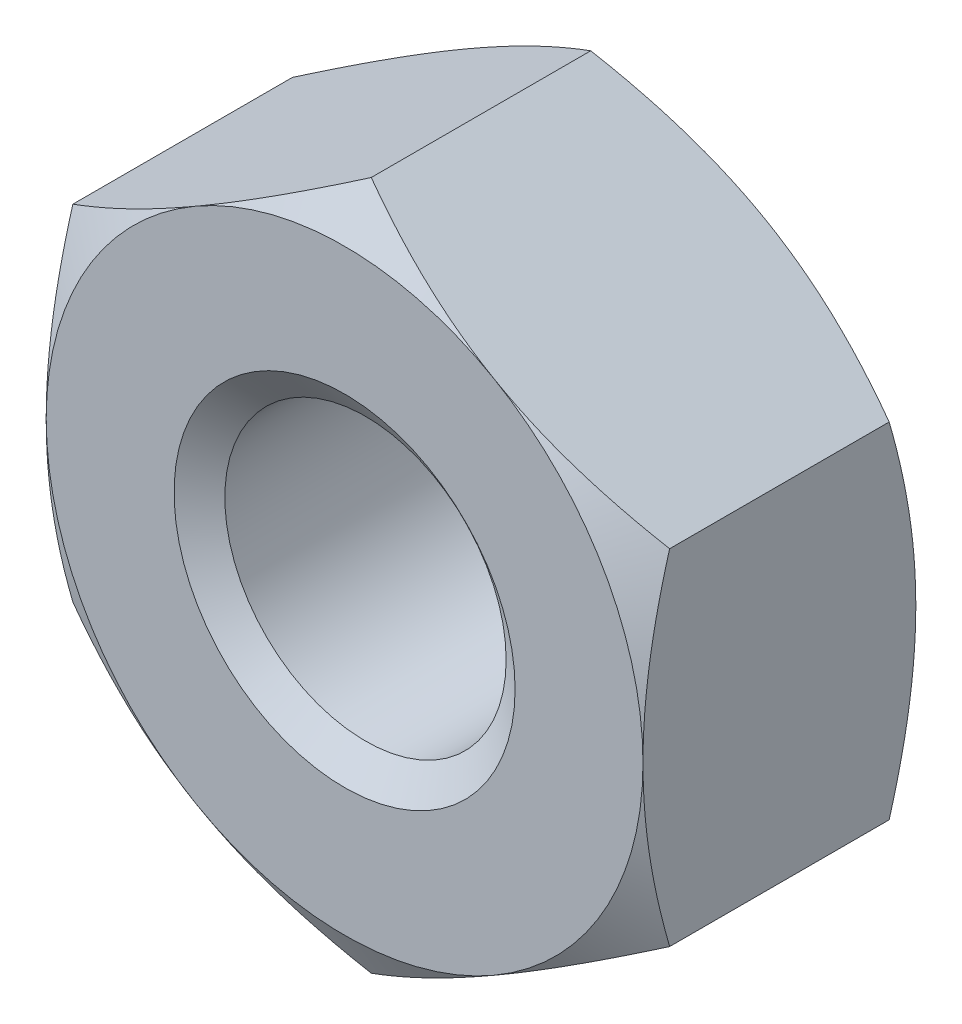
ISO-10303-21;
HEADER;
FILE_DESCRIPTION(('STEP AP214'),'2;1');
FILE_NAME('part.step','',(''),(''),'','','');
FILE_SCHEMA(('AUTOMOTIVE_DESIGN { 1 0 10303 214 1 1 1 1 }'));
ENDSEC;
DATA;
#1=APPLICATION_CONTEXT('core data for automotive mechanical design processes');
#2=APPLICATION_PROTOCOL_DEFINITION('international standard','automotive_design',2000,#1);
#3=PRODUCT_CONTEXT('',#1,'mechanical');
#4=PRODUCT('Part','Part','',(#3));
#5=PRODUCT_RELATED_PRODUCT_CATEGORY('part','',(#4));
#6=PRODUCT_DEFINITION_FORMATION('','',#4);
#7=PRODUCT_DEFINITION_CONTEXT('part definition',#1,'design');
#8=PRODUCT_DEFINITION('design','',#6,#7);
#9=PRODUCT_DEFINITION_SHAPE('','',#8);
#10=(LENGTH_UNIT() NAMED_UNIT(*) SI_UNIT(.MILLI.,.METRE.));
#11=(NAMED_UNIT(*) PLANE_ANGLE_UNIT() SI_UNIT($,.RADIAN.));
#12=(NAMED_UNIT(*) SI_UNIT($,.STERADIAN.) SOLID_ANGLE_UNIT());
#13=UNCERTAINTY_MEASURE_WITH_UNIT(LENGTH_MEASURE(1.E-05),#10,'distance_accuracy_value','');
#14=(GEOMETRIC_REPRESENTATION_CONTEXT(3) GLOBAL_UNCERTAINTY_ASSIGNED_CONTEXT((#13)) GLOBAL_UNIT_ASSIGNED_CONTEXT((#10,
#11,#12)) REPRESENTATION_CONTEXT('',''));
#15=CARTESIAN_POINT('',(0.,0.,0.));
#16=DIRECTION('',(0.,0.,1.));
#17=DIRECTION('',(1.,0.,0.));
#18=AXIS2_PLACEMENT_3D('',#15,#16,#17);
#19=CARTESIAN_POINT('',(0.,0.,-3.2));
#20=DIRECTION('',(0.,0.,1.));
#21=DIRECTION('',(1.,0.,0.));
#22=AXIS2_PLACEMENT_3D('',#19,#20,#21);
#23=CYLINDRICAL_SURFACE('',#22,1.65);
#24=CARTESIAN_POINT('',(0.,0.,-0.245072638373399));
#25=DIRECTION('',(0.,0.,1.));
#26=DIRECTION('',(1.,0.,0.));
#27=AXIS2_PLACEMENT_3D('',#24,#25,#26);
#28=CIRCLE('',#27,1.65);
#29=CARTESIAN_POINT('',(1.65,0.,-0.245072638373399));
#30=VERTEX_POINT('',#29);
#31=EDGE_CURVE('E175',#30,#30,#28,.F.);
#32=ORIENTED_EDGE('',*,*,#31,.F.);
#33=EDGE_LOOP('',(#32));
#34=FACE_BOUND('',#33,.T.);
#35=CARTESIAN_POINT('',(0.,0.,-2.9295273616266));
#36=DIRECTION('',(0.,0.,-1.));
#37=DIRECTION('',(-1.,0.,0.));
#38=AXIS2_PLACEMENT_3D('',#35,#36,#37);
#39=CIRCLE('',#38,1.65);
#40=CARTESIAN_POINT('',(-1.65,0.,-2.9295273616266));
#41=VERTEX_POINT('',#40);
#42=EDGE_CURVE('E40',#41,#41,#39,.F.);
#43=ORIENTED_EDGE('',*,*,#42,.F.);
#44=EDGE_LOOP('',(#43));
#45=FACE_BOUND('',#44,.T.);
#46=ADVANCED_FACE('F35',(#34,#45),#23,.F.);
#47=CARTESIAN_POINT('',(0.,4.04145188432738,-3.2));
#48=DIRECTION('',(-0.500000000000001,0.866025403784438,0.));
#49=DIRECTION('',(-0.866025403784438,-0.500000000000001,0.));
#50=AXIS2_PLACEMENT_3D('',#47,#48,#49);
#51=PLANE('',#50);
#52=DIRECTION('',(0.,0.,1.));
#53=VECTOR('',#52,1.);
#54=CARTESIAN_POINT('',(-3.5,2.02072594216369,-3.2));
#55=LINE('',#54,#53);
#56=CARTESIAN_POINT('',(-3.5,2.02072594216369,-2.88739260883036));
#57=VERTEX_POINT('',#56);
#58=CARTESIAN_POINT('',(-3.5,2.02072594216369,-0.312607391169643));
#59=VERTEX_POINT('',#58);
#60=EDGE_CURVE('E165',#57,#59,#55,.T.);
#61=ORIENTED_EDGE('',*,*,#60,.T.);
#62=CARTESIAN_POINT('',(-3.5002,2.02061047210985,-0.312674060693371));
#63=CARTESIAN_POINT('',(-3.34639282154755,2.10941108799267,-0.261385788989983));
#64=CARTESIAN_POINT('',(-3.19125798916558,2.19897822522909,-0.214740953816197));
#65=CARTESIAN_POINT('',(-2.87830199342322,2.37966345361545,-0.133321875533348));
#66=CARTESIAN_POINT('',(-2.7204752692125,2.47078475532382,-0.0985764355845608));
#67=CARTESIAN_POINT('',(-2.40677778961987,2.65189807961073,-0.0444900271828354));
#68=CARTESIAN_POINT('',(-2.25095530083931,2.74186223545399,-0.0247890862603809));
#69=CARTESIAN_POINT('',(-1.93857711279463,2.92221386641056,-0.00127013273725365));
#70=CARTESIAN_POINT('',(-1.78202254896577,3.01260068598001,0.00256735545443562));
#71=CARTESIAN_POINT('',(-1.48949078007901,3.1814939814933,-0.00541530187697704));
#72=CARTESIAN_POINT('',(-1.35346978754209,3.26002573814993,-0.0152754340696068));
#73=CARTESIAN_POINT('',(-1.08231397971101,3.41657761679354,-0.0465264668994035));
#74=CARTESIAN_POINT('',(-0.947180102315318,3.49459719728458,-0.0679280432857982));
#75=CARTESIAN_POINT('',(-0.675465207594817,3.65147186489429,-0.121430407880577));
#76=CARTESIAN_POINT('',(-0.538918580721665,3.73030709667644,-0.153757994445087));
#77=CARTESIAN_POINT('',(-0.267861907055499,3.88680174018324,-0.227128933807995));
#78=CARTESIAN_POINT('',(-0.133348387531464,3.96446315689009,-0.268155046569868));
#79=CARTESIAN_POINT('',(0.000199999999999524,4.04156735438122,-0.312674060693372));
#80=B_SPLINE_CURVE_WITH_KNOTS('',3,(#62,#63,#64,#65,#66,#67,#68,#69,#70,#71,#72,#73,#74,#75,#76,
#77,#78,#79),.UNSPECIFIED.,.F.,.F.,(4,2,2,2,2,2,2,2,4),(0.,0.554793832886254,1.11092123814984,
1.65328467083219,2.19498204478403,2.6666513085086,3.13875761298267,3.6213361260051,
4.10296698719187),.UNSPECIFIED.);
#81=CARTESIAN_POINT('',(-1.75,3.03108891324553,0.));
#82=VERTEX_POINT('',#81);
#83=EDGE_CURVE('E134',#59,#82,#80,.T.);
#84=ORIENTED_EDGE('',*,*,#83,.T.);
#85=CARTESIAN_POINT('',(0.,4.04145188432738,-0.312607391169644));
#86=VERTEX_POINT('',#85);
#87=EDGE_CURVE('E54',#82,#86,#80,.T.);
#88=ORIENTED_EDGE('',*,*,#87,.T.);
#89=DIRECTION('',(0.,0.,1.));
#90=VECTOR('',#89,1.);
#91=CARTESIAN_POINT('',(0.,4.04145188432738,-3.2));
#92=LINE('',#91,#90);
#93=CARTESIAN_POINT('',(0.,4.04145188432738,-2.88739260883036));
#94=VERTEX_POINT('',#93);
#95=EDGE_CURVE('E150',#94,#86,#92,.T.);
#96=ORIENTED_EDGE('',*,*,#95,.F.);
#97=CARTESIAN_POINT('',(-3.5002,2.02061047210985,-2.88732593930663));
#98=CARTESIAN_POINT('',(-3.34639282154755,2.10941108799267,-2.93861421101002));
#99=CARTESIAN_POINT('',(-3.19125798916558,2.19897822522909,-2.9852590461838));
#100=CARTESIAN_POINT('',(-2.87830199342322,2.37966345361545,-3.06667812446665));
#101=CARTESIAN_POINT('',(-2.7204752692125,2.47078475532382,-3.10142356441544));
#102=CARTESIAN_POINT('',(-2.40677778961987,2.65189807961073,-3.15550997281716));
#103=CARTESIAN_POINT('',(-2.25095530083931,2.74186223545399,-3.17521091373962));
#104=CARTESIAN_POINT('',(-1.93857711279463,2.92221386641055,-3.19872986726275));
#105=CARTESIAN_POINT('',(-1.78202254896577,3.01260068598001,-3.20256735545444));
#106=CARTESIAN_POINT('',(-1.48949078007901,3.1814939814933,-3.19458469812302));
#107=CARTESIAN_POINT('',(-1.35346978754209,3.26002573814993,-3.18472456593039));
#108=CARTESIAN_POINT('',(-1.08231397971101,3.41657761679354,-3.1534735331006));
#109=CARTESIAN_POINT('',(-0.947180102315318,3.49459719728458,-3.1320719567142));
#110=CARTESIAN_POINT('',(-0.675465207594817,3.65147186489429,-3.07856959211942));
#111=CARTESIAN_POINT('',(-0.538918580721665,3.73030709667644,-3.04624200555491));
#112=CARTESIAN_POINT('',(-0.267861907055499,3.88680174018324,-2.97287106619201));
#113=CARTESIAN_POINT('',(-0.133348387531464,3.96446315689009,-2.93184495343013));
#114=CARTESIAN_POINT('',(0.000199999999999536,4.04156735438122,-2.88732593930663));
#115=B_SPLINE_CURVE_WITH_KNOTS('',3,(#97,#98,#99,#100,#101,#102,#103,#104,#105,#106,#107,#108,
#109,#110,#111,#112,#113,#114),.UNSPECIFIED.,.F.,.F.,(4,2,2,2,2,2,2,2,4),(0.,0.554793832886254,
1.11092123814984,1.65328467083219,2.19498204478403,2.6666513085086,3.13875761298267,
3.6213361260051,4.10296698719187),.UNSPECIFIED.);
#116=CARTESIAN_POINT('',(-1.75,3.03108891324553,-3.2));
#117=VERTEX_POINT('',#116);
#118=EDGE_CURVE('E168',#117,#94,#115,.T.);
#119=ORIENTED_EDGE('',*,*,#118,.F.);
#120=EDGE_CURVE('E260',#57,#117,#115,.T.);
#121=ORIENTED_EDGE('',*,*,#120,.F.);
#122=EDGE_LOOP('',(#61,#84,#88,#96,#119,#121));
#123=FACE_BOUND('',#122,.T.);
#124=ADVANCED_FACE('F37',(#123),#51,.T.);
#125=CARTESIAN_POINT('',(3.5,2.02072594216369,-3.2));
#126=DIRECTION('',(0.5,0.866025403784438,0.));
#127=DIRECTION('',(-0.866025403784438,0.5,0.));
#128=AXIS2_PLACEMENT_3D('',#125,#126,#127);
#129=PLANE('',#128);
#130=ORIENTED_EDGE('',*,*,#95,.T.);
#131=CARTESIAN_POINT('',(-0.000200000000000528,4.04156735438122,-0.312674060693372));
#132=CARTESIAN_POINT('',(0.153607178452449,3.9527667384984,-0.261385788989985));
#133=CARTESIAN_POINT('',(0.308742010834424,3.86319960126198,-0.214740953816198));
#134=CARTESIAN_POINT('',(0.621698006576781,3.68251437287562,-0.133321875533349));
#135=CARTESIAN_POINT('',(0.779524730787496,3.59139307116725,-0.0985764355845617));
#136=CARTESIAN_POINT('',(1.09322221038013,3.41027974688034,-0.044490027182836));
#137=CARTESIAN_POINT('',(1.24904469916069,3.32031559103708,-0.0247890862603814));
#138=CARTESIAN_POINT('',(1.56142288720537,3.13996396008052,-0.00127013273725395));
#139=CARTESIAN_POINT('',(1.71797745103423,3.04957714051106,0.0025673554544353));
#140=CARTESIAN_POINT('',(2.01050921992099,2.88068384499777,-0.00541530187697722));
#141=CARTESIAN_POINT('',(2.14653021245791,2.80215208834114,-0.0152754340696068));
#142=CARTESIAN_POINT('',(2.417686020289,2.64560020969753,-0.0465264668994033));
#143=CARTESIAN_POINT('',(2.55281989768468,2.5675806292065,-0.0679280432857978));
#144=CARTESIAN_POINT('',(2.82453479240518,2.41070596159678,-0.121430407880577));
#145=CARTESIAN_POINT('',(2.96108141927834,2.33187072981463,-0.153757994445087));
#146=CARTESIAN_POINT('',(3.2321380929445,2.17537608630783,-0.227128933807994));
#147=CARTESIAN_POINT('',(3.36665161246854,2.09771466960098,-0.268155046569867));
#148=CARTESIAN_POINT('',(3.5002,2.02061047210985,-0.312674060693371));
#149=B_SPLINE_CURVE_WITH_KNOTS('',3,(#131,#132,#133,#134,#135,#136,#137,#138,#139,#140,#141,
#142,#143,#144,#145,#146,#147,#148),.UNSPECIFIED.,.F.,.F.,(4,2,2,2,2,2,2,2,4),(0.,
0.554793832886254,1.11092123814984,1.65328467083219,2.19498204478403,2.6666513085086,
3.13875761298267,3.6213361260051,4.10296698719187),.UNSPECIFIED.);
#150=CARTESIAN_POINT('',(1.75,3.03108891324554,0.));
#151=VERTEX_POINT('',#150);
#152=EDGE_CURVE('E144',#86,#151,#149,.T.);
#153=ORIENTED_EDGE('',*,*,#152,.T.);
#154=CARTESIAN_POINT('',(3.5,2.02072594216369,-0.312607391169644));
#155=VERTEX_POINT('',#154);
#156=EDGE_CURVE('E61',#151,#155,#149,.T.);
#157=ORIENTED_EDGE('',*,*,#156,.T.);
#158=DIRECTION('',(0.,0.,1.));
#159=VECTOR('',#158,1.);
#160=CARTESIAN_POINT('',(3.5,2.02072594216369,-3.2));
#161=LINE('',#160,#159);
#162=CARTESIAN_POINT('',(3.5,2.02072594216369,-2.88739260883036));
#163=VERTEX_POINT('',#162);
#164=EDGE_CURVE('E143',#163,#155,#161,.T.);
#165=ORIENTED_EDGE('',*,*,#164,.F.);
#166=CARTESIAN_POINT('',(-0.000200000000000514,4.04156735438122,-2.88732593930663));
#167=CARTESIAN_POINT('',(0.153607178452449,3.9527667384984,-2.93861421101002));
#168=CARTESIAN_POINT('',(0.308742010834424,3.86319960126198,-2.9852590461838));
#169=CARTESIAN_POINT('',(0.621698006576781,3.68251437287562,-3.06667812446665));
#170=CARTESIAN_POINT('',(0.779524730787496,3.59139307116725,-3.10142356441544));
#171=CARTESIAN_POINT('',(1.09322221038013,3.41027974688034,-3.15550997281716));
#172=CARTESIAN_POINT('',(1.24904469916069,3.32031559103708,-3.17521091373962));
#173=CARTESIAN_POINT('',(1.56142288720537,3.13996396008052,-3.19872986726275));
#174=CARTESIAN_POINT('',(1.71797745103423,3.04957714051106,-3.20256735545444));
#175=CARTESIAN_POINT('',(2.01050921992099,2.88068384499777,-3.19458469812302));
#176=CARTESIAN_POINT('',(2.14653021245791,2.80215208834114,-3.18472456593039));
#177=CARTESIAN_POINT('',(2.417686020289,2.64560020969753,-3.1534735331006));
#178=CARTESIAN_POINT('',(2.55281989768468,2.5675806292065,-3.1320719567142));
#179=CARTESIAN_POINT('',(2.82453479240518,2.41070596159678,-3.07856959211942));
#180=CARTESIAN_POINT('',(2.96108141927834,2.33187072981463,-3.04624200555491));
#181=CARTESIAN_POINT('',(3.2321380929445,2.17537608630783,-2.97287106619201));
#182=CARTESIAN_POINT('',(3.36665161246854,2.09771466960098,-2.93184495343013));
#183=CARTESIAN_POINT('',(3.5002,2.02061047210985,-2.88732593930663));
#184=B_SPLINE_CURVE_WITH_KNOTS('',3,(#166,#167,#168,#169,#170,#171,#172,#173,#174,#175,#176,
#177,#178,#179,#180,#181,#182,#183),.UNSPECIFIED.,.F.,.F.,(4,2,2,2,2,2,2,2,4),(0.,
0.554793832886254,1.11092123814984,1.65328467083219,2.19498204478403,2.6666513085086,
3.13875761298267,3.6213361260051,4.10296698719187),.UNSPECIFIED.);
#185=CARTESIAN_POINT('',(1.75,3.03108891324554,-3.2));
#186=VERTEX_POINT('',#185);
#187=EDGE_CURVE('E254',#186,#163,#184,.T.);
#188=ORIENTED_EDGE('',*,*,#187,.F.);
#189=EDGE_CURVE('E259',#94,#186,#184,.T.);
#190=ORIENTED_EDGE('',*,*,#189,.F.);
#191=EDGE_LOOP('',(#130,#153,#157,#165,#188,#190));
#192=FACE_BOUND('',#191,.T.);
#193=ADVANCED_FACE('F141',(#192),#129,.T.);
#194=CARTESIAN_POINT('',(3.5,2.02072594216369,-3.2));
#195=DIRECTION('',(-1.,0.,0.));
#196=DIRECTION('',(0.,0.,1.));
#197=AXIS2_PLACEMENT_3D('',#194,#195,#196);
#198=PLANE('',#197);
#199=CARTESIAN_POINT('',(3.5,-5.35926299121405,-1.67484346858556));
#200=CARTESIAN_POINT('',(3.5,-5.20559319908841,-1.60058173692104));
#201=CARTESIAN_POINT('',(3.5,-5.05156008083375,-1.52705822833147));
#202=CARTESIAN_POINT('',(3.5,-4.7425707418071,-1.38190950344752));
#203=CARTESIAN_POINT('',(3.5,-4.58761436682436,-1.31028461582133));
#204=CARTESIAN_POINT('',(3.5,-4.27574500225542,-1.16897765517624));
#205=CARTESIAN_POINT('',(3.5,-4.11882589028192,-1.09930904568016));
#206=CARTESIAN_POINT('',(3.5,-3.80369792903855,-0.962964262242759));
#207=CARTESIAN_POINT('',(3.5,-3.64548914750595,-0.896287932319517));
#208=CARTESIAN_POINT('',(3.5,-3.32556618401855,-0.765931819095066));
#209=CARTESIAN_POINT('',(3.5,-3.16383281219923,-0.702298873688864));
#210=CARTESIAN_POINT('',(3.5,-2.83845840945597,-0.580016702089492));
#211=CARTESIAN_POINT('',(3.5,-2.67481716858826,-0.521368030370691));
#212=CARTESIAN_POINT('',(3.5,-2.34570278472049,-0.410630279877021));
#213=CARTESIAN_POINT('',(3.5,-2.18023438248742,-0.358527255435857));
#214=CARTESIAN_POINT('',(3.5,-1.8469452280637,-0.262572936976443));
#215=CARTESIAN_POINT('',(3.5,-1.6791252378753,-0.218719033467158));
#216=CARTESIAN_POINT('',(3.5,-1.34101828610925,-0.141391945584786));
#217=CARTESIAN_POINT('',(3.5,-1.17073068027693,-0.107921525211972));
#218=CARTESIAN_POINT('',(3.5,-0.828102385138484,-0.0536149564320501));
#219=CARTESIAN_POINT('',(3.5,-0.655761694017301,-0.0327788191952362));
#220=CARTESIAN_POINT('',(3.5,-0.311020490924449,-0.00558408650575637));
#221=CARTESIAN_POINT('',(3.5,-0.138627397207259,0.00086616316591159));
#222=CARTESIAN_POINT('',(3.5,0.206038074906535,-0.00105355807794593));
#223=CARTESIAN_POINT('',(3.5,0.37831047302318,-0.00941968196343189));
#224=CARTESIAN_POINT('',(3.5,0.672490555822328,-0.0357688927868921));
#225=CARTESIAN_POINT('',(3.5,0.794722791084093,-0.0503206340384214));
#226=CARTESIAN_POINT('',(3.5,1.0382430543056,-0.0859367340533557));
#227=CARTESIAN_POINT('',(3.5,1.15953093025887,-0.107002119926141));
#228=CARTESIAN_POINT('',(3.5,1.52187914771348,-0.178863187081453));
#229=CARTESIAN_POINT('',(3.5,1.76124104212632,-0.23830527562201));
#230=CARTESIAN_POINT('',(3.5,2.11940971387709,-0.340826814402555));
#231=CARTESIAN_POINT('',(3.5,2.24008344316347,-0.377749699085184));
#232=CARTESIAN_POINT('',(3.5,2.48017139213729,-0.455249007699294));
#233=CARTESIAN_POINT('',(3.5,2.59958641795613,-0.495822911663551));
#234=CARTESIAN_POINT('',(3.5,2.83665760451799,-0.579779986782753));
#235=CARTESIAN_POINT('',(3.5,2.95431988203484,-0.623146060034315));
#236=CARTESIAN_POINT('',(3.5,3.188731535088,-0.712423559566866));
#237=CARTESIAN_POINT('',(3.5,3.30548051959464,-0.75833601459295));
#238=CARTESIAN_POINT('',(3.5,3.42180736613349,-0.805270380724071));
#239=B_SPLINE_CURVE_WITH_KNOTS('',3,(#199,#200,#201,#202,#203,#204,#205,#206,#207,#208,#209,
#210,#211,#212,#213,#214,#215,#216,#217,#218,#219,#220,#221,#222,#223,#224,#225,#226,#227,#228,
#229,#230,#231,#232,#233,#234,#235,#236,#237,#238),.UNSPECIFIED.,.F.,.F.,(4,2,2,2,2,2,2,2,2,2,2,
2,2,2,2,2,2,2,2,4),(0.,0.512025318465737,1.02413870177436,1.53918270315241,2.05419982499223,
2.57553975872798,3.09693761309353,3.617205066104,4.13730766217537,4.65754858684364,
5.17778997146961,5.69470725122282,6.211490334524,6.58059623222331,6.94976036239484,
7.68863804939851,8.06719621660478,8.4454950747676,8.82166461280099,9.1979872473341),.UNSPECIFIED.);
#240=CARTESIAN_POINT('',(3.5,-2.02072594216369,-0.312607391169644));
#241=VERTEX_POINT('',#240);
#242=CARTESIAN_POINT('',(3.5,0.,0.));
#243=VERTEX_POINT('',#242);
#244=EDGE_CURVE('E136',#241,#243,#239,.T.);
#245=ORIENTED_EDGE('',*,*,#244,.F.);
#246=DIRECTION('',(0.,0.,1.));
#247=VECTOR('',#246,1.);
#248=CARTESIAN_POINT('',(3.5,-2.02072594216369,-3.2));
#249=LINE('',#248,#247);
#250=CARTESIAN_POINT('',(3.5,-2.02072594216369,-2.88739260883036));
#251=VERTEX_POINT('',#250);
#252=EDGE_CURVE('E151',#251,#241,#249,.T.);
#253=ORIENTED_EDGE('',*,*,#252,.F.);
#254=CARTESIAN_POINT('',(3.5,-5.35926299121405,-1.52515653141444));
#255=CARTESIAN_POINT('',(3.5,-5.20559319908841,-1.59941826307896));
#256=CARTESIAN_POINT('',(3.5,-5.05156008083375,-1.67294177166853));
#257=CARTESIAN_POINT('',(3.5,-4.7425707418071,-1.81809049655248));
#258=CARTESIAN_POINT('',(3.5,-4.58761436682436,-1.88971538417867));
#259=CARTESIAN_POINT('',(3.5,-4.27574500225542,-2.03102234482376));
#260=CARTESIAN_POINT('',(3.5,-4.11882589028192,-2.10069095431984));
#261=CARTESIAN_POINT('',(3.5,-3.80369792903855,-2.23703573775724));
#262=CARTESIAN_POINT('',(3.5,-3.64548914750595,-2.30371206768048));
#263=CARTESIAN_POINT('',(3.5,-3.32556618401855,-2.43406818090493));
#264=CARTESIAN_POINT('',(3.5,-3.16383281219923,-2.49770112631114));
#265=CARTESIAN_POINT('',(3.5,-2.83845840945597,-2.61998329791051));
#266=CARTESIAN_POINT('',(3.5,-2.67481716858826,-2.67863196962931));
#267=CARTESIAN_POINT('',(3.5,-2.34570278472049,-2.78936972012298));
#268=CARTESIAN_POINT('',(3.5,-2.18023438248742,-2.84147274456414));
#269=CARTESIAN_POINT('',(3.5,-1.8469452280637,-2.93742706302356));
#270=CARTESIAN_POINT('',(3.5,-1.6791252378753,-2.98128096653284));
#271=CARTESIAN_POINT('',(3.5,-1.34101828610925,-3.05860805441521));
#272=CARTESIAN_POINT('',(3.5,-1.17073068027693,-3.09207847478803));
#273=CARTESIAN_POINT('',(3.5,-0.828102385138484,-3.14638504356795));
#274=CARTESIAN_POINT('',(3.5,-0.655761694017301,-3.16722118080476));
#275=CARTESIAN_POINT('',(3.5,-0.311020490924449,-3.19441591349424));
#276=CARTESIAN_POINT('',(3.5,-0.13862739720726,-3.20086616316591));
#277=CARTESIAN_POINT('',(3.5,0.206038074906535,-3.19894644192205));
#278=CARTESIAN_POINT('',(3.5,0.37831047302318,-3.19058031803657));
#279=CARTESIAN_POINT('',(3.5,0.672490555822328,-3.16423110721311));
#280=CARTESIAN_POINT('',(3.5,0.794722791084093,-3.14967936596158));
#281=CARTESIAN_POINT('',(3.5,1.0382430543056,-3.11406326594664));
#282=CARTESIAN_POINT('',(3.5,1.15953093025887,-3.09299788007386));
#283=CARTESIAN_POINT('',(3.5,1.52187914771348,-3.02113681291855));
#284=CARTESIAN_POINT('',(3.5,1.76124104212632,-2.96169472437799));
#285=CARTESIAN_POINT('',(3.5,2.11940971387709,-2.85917318559745));
#286=CARTESIAN_POINT('',(3.5,2.24008344316347,-2.82225030091482));
#287=CARTESIAN_POINT('',(3.5,2.48017139213729,-2.74475099230071));
#288=CARTESIAN_POINT('',(3.5,2.59958641795613,-2.70417708833645));
#289=CARTESIAN_POINT('',(3.5,2.83665760451799,-2.62022001321725));
#290=CARTESIAN_POINT('',(3.5,2.95431988203484,-2.57685393996569));
#291=CARTESIAN_POINT('',(3.5,3.188731535088,-2.48757644043313));
#292=CARTESIAN_POINT('',(3.5,3.30548051959464,-2.44166398540705));
#293=CARTESIAN_POINT('',(3.5,3.42180736613349,-2.39472961927593));
#294=B_SPLINE_CURVE_WITH_KNOTS('',3,(#254,#255,#256,#257,#258,#259,#260,#261,#262,#263,#264,
#265,#266,#267,#268,#269,#270,#271,#272,#273,#274,#275,#276,#277,#278,#279,#280,#281,#282,#283,
#284,#285,#286,#287,#288,#289,#290,#291,#292,#293),.UNSPECIFIED.,.F.,.F.,(4,2,2,2,2,2,2,2,2,2,2,
2,2,2,2,2,2,2,2,4),(0.,0.512025318465737,1.02413870177436,1.53918270315241,2.05419982499223,
2.57553975872798,3.09693761309353,3.617205066104,4.13730766217537,4.65754858684364,
5.17778997146961,5.69470725122282,6.211490334524,6.58059623222331,6.94976036239484,
7.68863804939851,8.06719621660478,8.4454950747676,8.82166461280099,9.1979872473341),.UNSPECIFIED.);
#295=CARTESIAN_POINT('',(3.5,0.,-3.2));
#296=VERTEX_POINT('',#295);
#297=EDGE_CURVE('E266',#251,#296,#294,.T.);
#298=ORIENTED_EDGE('',*,*,#297,.T.);
#299=EDGE_CURVE('E149',#296,#163,#294,.T.);
#300=ORIENTED_EDGE('',*,*,#299,.T.);
#301=ORIENTED_EDGE('',*,*,#164,.T.);
#302=EDGE_CURVE('E126',#243,#155,#239,.T.);
#303=ORIENTED_EDGE('',*,*,#302,.F.);
#304=EDGE_LOOP('',(#245,#253,#298,#300,#301,#303));
#305=FACE_BOUND('',#304,.T.);
#306=ADVANCED_FACE('F147',(#305),#198,.F.);
#307=CARTESIAN_POINT('',(0.,-4.04145188432739,-3.2));
#308=DIRECTION('',(0.5,-0.866025403784438,0.));
#309=DIRECTION('',(0.866025403784438,0.5,0.));
#310=AXIS2_PLACEMENT_3D('',#307,#308,#309);
#311=PLANE('',#310);
#312=ORIENTED_EDGE('',*,*,#252,.T.);
#313=CARTESIAN_POINT('',(3.5002,-2.02061047210986,-0.312674060693372));
#314=CARTESIAN_POINT('',(3.34639282154755,-2.10941108799267,-0.261385788989985));
#315=CARTESIAN_POINT('',(3.19125798916558,-2.19897822522909,-0.214740953816198));
#316=CARTESIAN_POINT('',(2.87830199342322,-2.37966345361545,-0.13332187553335));
#317=CARTESIAN_POINT('',(2.7204752692125,-2.47078475532383,-0.0985764355845625));
#318=CARTESIAN_POINT('',(2.40677778961987,-2.65189807961074,-0.0444900271828371));
#319=CARTESIAN_POINT('',(2.25095530083931,-2.741862235454,-0.0247890862603824));
#320=CARTESIAN_POINT('',(1.93857711279463,-2.92221386641056,-0.0012701327372554));
#321=CARTESIAN_POINT('',(1.78202254896577,-3.01260068598001,0.00256735545443344));
#322=CARTESIAN_POINT('',(1.48949078007901,-3.1814939814933,-0.00541530187697946));
#323=CARTESIAN_POINT('',(1.35346978754209,-3.26002573814993,-0.015275434069609));
#324=CARTESIAN_POINT('',(1.082313979711,-3.41657761679354,-0.0465264668994057));
#325=CARTESIAN_POINT('',(0.947180102315317,-3.49459719728458,-0.0679280432858004));
#326=CARTESIAN_POINT('',(0.675465207594815,-3.65147186489429,-0.12143040788058));
#327=CARTESIAN_POINT('',(0.538918580721664,-3.73030709667644,-0.15375799444509));
#328=CARTESIAN_POINT('',(0.267861907055498,-3.88680174018325,-0.227128933807997));
#329=CARTESIAN_POINT('',(0.133348387531463,-3.96446315689009,-0.26815504656987));
#330=CARTESIAN_POINT('',(-0.000199999999999833,-4.04156735438122,-0.312674060693374));
#331=B_SPLINE_CURVE_WITH_KNOTS('',3,(#313,#314,#315,#316,#317,#318,#319,#320,#321,#322,#323,
#324,#325,#326,#327,#328,#329,#330),.UNSPECIFIED.,.F.,.F.,(4,2,2,2,2,2,2,2,4),(0.,
0.554793832886254,1.11092123814984,1.65328467083219,2.19498204478403,2.6666513085086,
3.13875761298267,3.6213361260051,4.10296698719187),.UNSPECIFIED.);
#332=CARTESIAN_POINT('',(1.75,-3.03108891324553,0.));
#333=VERTEX_POINT('',#332);
#334=EDGE_CURVE('E360',#241,#333,#331,.T.);
#335=ORIENTED_EDGE('',*,*,#334,.T.);
#336=CARTESIAN_POINT('',(0.,-4.04145188432738,-0.312607391169644));
#337=VERTEX_POINT('',#336);
#338=EDGE_CURVE('E226',#333,#337,#331,.T.);
#339=ORIENTED_EDGE('',*,*,#338,.T.);
#340=DIRECTION('',(0.,0.,1.));
#341=VECTOR('',#340,1.);
#342=CARTESIAN_POINT('',(0.,-4.04145188432739,-3.2));
#343=LINE('',#342,#341);
#344=CARTESIAN_POINT('',(0.,-4.04145188432738,-2.88739260883036));
#345=VERTEX_POINT('',#344);
#346=EDGE_CURVE('E156',#345,#337,#343,.T.);
#347=ORIENTED_EDGE('',*,*,#346,.F.);
#348=CARTESIAN_POINT('',(3.5002,-2.02061047210986,-2.88732593930663));
#349=CARTESIAN_POINT('',(3.34639282154755,-2.10941108799267,-2.93861421101002));
#350=CARTESIAN_POINT('',(3.19125798916558,-2.19897822522909,-2.9852590461838));
#351=CARTESIAN_POINT('',(2.87830199342322,-2.37966345361545,-3.06667812446665));
#352=CARTESIAN_POINT('',(2.7204752692125,-2.47078475532383,-3.10142356441544));
#353=CARTESIAN_POINT('',(2.40677778961987,-2.65189807961074,-3.15550997281716));
#354=CARTESIAN_POINT('',(2.25095530083931,-2.741862235454,-3.17521091373962));
#355=CARTESIAN_POINT('',(1.93857711279463,-2.92221386641056,-3.19872986726274));
#356=CARTESIAN_POINT('',(1.78202254896577,-3.01260068598001,-3.20256735545443));
#357=CARTESIAN_POINT('',(1.48949078007901,-3.1814939814933,-3.19458469812302));
#358=CARTESIAN_POINT('',(1.35346978754209,-3.26002573814993,-3.18472456593039));
#359=CARTESIAN_POINT('',(1.082313979711,-3.41657761679354,-3.15347353310059));
#360=CARTESIAN_POINT('',(0.947180102315316,-3.49459719728458,-3.1320719567142));
#361=CARTESIAN_POINT('',(0.675465207594815,-3.65147186489429,-3.07856959211942));
#362=CARTESIAN_POINT('',(0.538918580721664,-3.73030709667644,-3.04624200555491));
#363=CARTESIAN_POINT('',(0.267861907055498,-3.88680174018325,-2.972871066192));
#364=CARTESIAN_POINT('',(0.133348387531463,-3.96446315689009,-2.93184495343013));
#365=CARTESIAN_POINT('',(-0.000199999999999835,-4.04156735438122,-2.88732593930663));
#366=B_SPLINE_CURVE_WITH_KNOTS('',3,(#348,#349,#350,#351,#352,#353,#354,#355,#356,#357,#358,
#359,#360,#361,#362,#363,#364,#365),.UNSPECIFIED.,.F.,.F.,(4,2,2,2,2,2,2,2,4),(0.,
0.554793832886254,1.11092123814984,1.65328467083219,2.19498204478403,2.6666513085086,
3.13875761298267,3.6213361260051,4.10296698719187),.UNSPECIFIED.);
#367=CARTESIAN_POINT('',(1.75,-3.03108891324553,-3.2));
#368=VERTEX_POINT('',#367);
#369=EDGE_CURVE('E272',#368,#345,#366,.T.);
#370=ORIENTED_EDGE('',*,*,#369,.F.);
#371=EDGE_CURVE('E271',#251,#368,#366,.T.);
#372=ORIENTED_EDGE('',*,*,#371,.F.);
#373=EDGE_LOOP('',(#312,#335,#339,#347,#370,#372));
#374=FACE_BOUND('',#373,.T.);
#375=ADVANCED_FACE('F282',(#374),#311,.T.);
#376=CARTESIAN_POINT('',(-3.5,-2.02072594216369,-3.2));
#377=DIRECTION('',(-0.5,-0.866025403784438,0.));
#378=DIRECTION('',(0.866025403784439,-0.5,0.));
#379=AXIS2_PLACEMENT_3D('',#376,#377,#378);
#380=PLANE('',#379);
#381=ORIENTED_EDGE('',*,*,#346,.T.);
#382=CARTESIAN_POINT('',(0.00020000000000034,-4.04156735438122,-0.312674060693374));
#383=CARTESIAN_POINT('',(-0.153607178452449,-3.9527667384984,-0.261385788989986));
#384=CARTESIAN_POINT('',(-0.308742010834424,-3.86319960126198,-0.214740953816199));
#385=CARTESIAN_POINT('',(-0.621698006576782,-3.68251437287563,-0.133321875533351));
#386=CARTESIAN_POINT('',(-0.779524730787497,-3.59139307116725,-0.0985764355845636));
#387=CARTESIAN_POINT('',(-1.09322221038013,-3.41027974688034,-0.0444900271828381));
#388=CARTESIAN_POINT('',(-1.24904469916069,-3.32031559103708,-0.0247890862603834));
#389=CARTESIAN_POINT('',(-1.56142288720538,-3.13996396008052,-0.0012701327372559));
#390=CARTESIAN_POINT('',(-1.71797745103423,-3.04957714051106,0.00256735545443343));
#391=CARTESIAN_POINT('',(-2.01050921992099,-2.88068384499778,-0.0054153018769791));
#392=CARTESIAN_POINT('',(-2.14653021245791,-2.80215208834115,-0.0152754340696087));
#393=CARTESIAN_POINT('',(-2.417686020289,-2.64560020969754,-0.0465264668994052));
#394=CARTESIAN_POINT('',(-2.55281989768468,-2.5675806292065,-0.0679280432857998));
#395=CARTESIAN_POINT('',(-2.82453479240518,-2.41070596159679,-0.121430407880579));
#396=CARTESIAN_POINT('',(-2.96108141927834,-2.33187072981464,-0.153757994445088));
#397=CARTESIAN_POINT('',(-3.2321380929445,-2.17537608630783,-0.227128933807996));
#398=CARTESIAN_POINT('',(-3.36665161246854,-2.09771466960099,-0.268155046569868));
#399=CARTESIAN_POINT('',(-3.5002,-2.02061047210986,-0.312674060693372));
#400=B_SPLINE_CURVE_WITH_KNOTS('',3,(#382,#383,#384,#385,#386,#387,#388,#389,#390,#391,#392,
#393,#394,#395,#396,#397,#398,#399),.UNSPECIFIED.,.F.,.F.,(4,2,2,2,2,2,2,2,4),(0.,
0.554793832886255,1.11092123814984,1.65328467083219,2.19498204478403,2.6666513085086,
3.13875761298267,3.6213361260051,4.10296698719187),.UNSPECIFIED.);
#401=CARTESIAN_POINT('',(-1.75,-3.03108891324554,0.));
#402=VERTEX_POINT('',#401);
#403=EDGE_CURVE('E357',#337,#402,#400,.T.);
#404=ORIENTED_EDGE('',*,*,#403,.T.);
#405=CARTESIAN_POINT('',(-3.5,-2.02072594216369,-0.312607391169644));
#406=VERTEX_POINT('',#405);
#407=EDGE_CURVE('E200',#402,#406,#400,.T.);
#408=ORIENTED_EDGE('',*,*,#407,.T.);
#409=DIRECTION('',(0.,0.,1.));
#410=VECTOR('',#409,1.);
#411=CARTESIAN_POINT('',(-3.5,-2.02072594216369,-3.2));
#412=LINE('',#411,#410);
#413=CARTESIAN_POINT('',(-3.5,-2.02072594216369,-2.88739260883036));
#414=VERTEX_POINT('',#413);
#415=EDGE_CURVE('E162',#414,#406,#412,.T.);
#416=ORIENTED_EDGE('',*,*,#415,.F.);
#417=CARTESIAN_POINT('',(0.00020000000000025,-4.04156735438122,-2.88732593930663));
#418=CARTESIAN_POINT('',(-0.153607178452449,-3.9527667384984,-2.93861421101001));
#419=CARTESIAN_POINT('',(-0.308742010834424,-3.86319960126198,-2.9852590461838));
#420=CARTESIAN_POINT('',(-0.621698006576782,-3.68251437287563,-3.06667812446665));
#421=CARTESIAN_POINT('',(-0.779524730787497,-3.59139307116725,-3.10142356441544));
#422=CARTESIAN_POINT('',(-1.09322221038013,-3.41027974688034,-3.15550997281716));
#423=CARTESIAN_POINT('',(-1.24904469916069,-3.32031559103708,-3.17521091373962));
#424=CARTESIAN_POINT('',(-1.56142288720538,-3.13996396008052,-3.19872986726274));
#425=CARTESIAN_POINT('',(-1.71797745103423,-3.04957714051106,-3.20256735545443));
#426=CARTESIAN_POINT('',(-2.01050921992099,-2.88068384499778,-3.19458469812302));
#427=CARTESIAN_POINT('',(-2.14653021245791,-2.80215208834115,-3.18472456593039));
#428=CARTESIAN_POINT('',(-2.417686020289,-2.64560020969754,-3.1534735331006));
#429=CARTESIAN_POINT('',(-2.55281989768468,-2.5675806292065,-3.1320719567142));
#430=CARTESIAN_POINT('',(-2.82453479240518,-2.41070596159679,-3.07856959211942));
#431=CARTESIAN_POINT('',(-2.96108141927834,-2.33187072981464,-3.04624200555491));
#432=CARTESIAN_POINT('',(-3.2321380929445,-2.17537608630783,-2.972871066192));
#433=CARTESIAN_POINT('',(-3.36665161246854,-2.09771466960099,-2.93184495343013));
#434=CARTESIAN_POINT('',(-3.5002,-2.02061047210986,-2.88732593930663));
#435=B_SPLINE_CURVE_WITH_KNOTS('',3,(#417,#418,#419,#420,#421,#422,#423,#424,#425,#426,#427,
#428,#429,#430,#431,#432,#433,#434),.UNSPECIFIED.,.F.,.F.,(4,2,2,2,2,2,2,2,4),(0.,
0.554793832886254,1.11092123814984,1.65328467083219,2.19498204478403,2.6666513085086,
3.13875761298267,3.6213361260051,4.10296698719187),.UNSPECIFIED.);
#436=CARTESIAN_POINT('',(-1.75,-3.03108891324554,-3.2));
#437=VERTEX_POINT('',#436);
#438=EDGE_CURVE('E278',#437,#414,#435,.T.);
#439=ORIENTED_EDGE('',*,*,#438,.F.);
#440=EDGE_CURVE('E277',#345,#437,#435,.T.);
#441=ORIENTED_EDGE('',*,*,#440,.F.);
#442=EDGE_LOOP('',(#381,#404,#408,#416,#439,#441));
#443=FACE_BOUND('',#442,.T.);
#444=ADVANCED_FACE('F285',(#443),#380,.T.);
#445=CARTESIAN_POINT('',(-3.5,2.02072594216369,-3.2));
#446=DIRECTION('',(-1.,0.,0.));
#447=DIRECTION('',(0.,0.,1.));
#448=AXIS2_PLACEMENT_3D('',#445,#446,#447);
#449=PLANE('',#448);
#450=ORIENTED_EDGE('',*,*,#415,.T.);
#451=CARTESIAN_POINT('',(-3.5,-5.35926299121405,-1.67484346858556));
#452=CARTESIAN_POINT('',(-3.5,-5.20559319908842,-1.60058173692104));
#453=CARTESIAN_POINT('',(-3.5,-5.05156008083375,-1.52705822833147));
#454=CARTESIAN_POINT('',(-3.5,-4.7425707418071,-1.38190950344752));
#455=CARTESIAN_POINT('',(-3.5,-4.58761436682436,-1.31028461582133));
#456=CARTESIAN_POINT('',(-3.5,-4.27574500225542,-1.16897765517624));
#457=CARTESIAN_POINT('',(-3.5,-4.11882589028192,-1.09930904568016));
#458=CARTESIAN_POINT('',(-3.5,-3.80369792903855,-0.96296426224276));
#459=CARTESIAN_POINT('',(-3.5,-3.64548914750595,-0.896287932319518));
#460=CARTESIAN_POINT('',(-3.5,-3.32556618401855,-0.765931819095067));
#461=CARTESIAN_POINT('',(-3.5,-3.16383281219924,-0.702298873688865));
#462=CARTESIAN_POINT('',(-3.5,-2.83845840945597,-0.580016702089493));
#463=CARTESIAN_POINT('',(-3.5,-2.67481716858826,-0.521368030370692));
#464=CARTESIAN_POINT('',(-3.5,-2.34570278472049,-0.410630279877022));
#465=CARTESIAN_POINT('',(-3.5,-2.18023438248742,-0.358527255435857));
#466=CARTESIAN_POINT('',(-3.5,-1.8469452280637,-0.262572936976443));
#467=CARTESIAN_POINT('',(-3.5,-1.6791252378753,-0.218719033467158));
#468=CARTESIAN_POINT('',(-3.5,-1.34101828610925,-0.141391945584787));
#469=CARTESIAN_POINT('',(-3.5,-1.17073068027693,-0.107921525211973));
#470=CARTESIAN_POINT('',(-3.5,-0.828102385138485,-0.0536149564320504));
#471=CARTESIAN_POINT('',(-3.5,-0.655761694017302,-0.0327788191952365));
#472=CARTESIAN_POINT('',(-3.5,-0.31102049092445,-0.00558408650575658));
#473=CARTESIAN_POINT('',(-3.5,-0.13862739720726,0.000866163165911488));
#474=CARTESIAN_POINT('',(-3.5,0.206038074906534,-0.00105355807794583));
#475=CARTESIAN_POINT('',(-3.5,0.378310473023179,-0.00941968196343169));
#476=CARTESIAN_POINT('',(-3.5,0.672490555822327,-0.0357688927868918));
#477=CARTESIAN_POINT('',(-3.5,0.794722791084092,-0.0503206340384211));
#478=CARTESIAN_POINT('',(-3.5,1.0382430543056,-0.0859367340533555));
#479=CARTESIAN_POINT('',(-3.5,1.15953093025887,-0.107002119926141));
#480=CARTESIAN_POINT('',(-3.5,1.52187914771348,-0.178863187081452));
#481=CARTESIAN_POINT('',(-3.5,1.76124104212632,-0.23830527562201));
#482=CARTESIAN_POINT('',(-3.5,2.11940971387708,-0.340826814402554));
#483=CARTESIAN_POINT('',(-3.5,2.24008344316346,-0.377749699085183));
#484=CARTESIAN_POINT('',(-3.5,2.48017139213729,-0.455249007699293));
#485=CARTESIAN_POINT('',(-3.5,2.59958641795613,-0.49582291166355));
#486=CARTESIAN_POINT('',(-3.5,2.83665760451799,-0.579779986782752));
#487=CARTESIAN_POINT('',(-3.5,2.95431988203484,-0.623146060034314));
#488=CARTESIAN_POINT('',(-3.5,3.188731535088,-0.712423559566866));
#489=CARTESIAN_POINT('',(-3.5,3.30548051959464,-0.75833601459295));
#490=CARTESIAN_POINT('',(-3.5,3.42180736613349,-0.805270380724071));
#491=B_SPLINE_CURVE_WITH_KNOTS('',3,(#451,#452,#453,#454,#455,#456,#457,#458,#459,#460,#461,
#462,#463,#464,#465,#466,#467,#468,#469,#470,#471,#472,#473,#474,#475,#476,#477,#478,#479,#480,
#481,#482,#483,#484,#485,#486,#487,#488,#489,#490),.UNSPECIFIED.,.F.,.F.,(4,2,2,2,2,2,2,2,2,2,2,
2,2,2,2,2,2,2,2,4),(0.,0.512025318465737,1.02413870177436,1.53918270315241,2.05419982499223,
2.57553975872798,3.09693761309353,3.617205066104,4.13730766217537,4.65754858684364,
5.17778997146961,5.69470725122282,6.211490334524,6.58059623222331,6.94976036239484,
7.68863804939851,8.06719621660478,8.4454950747676,8.82166461280099,9.1979872473341),.UNSPECIFIED.);
#492=CARTESIAN_POINT('',(-3.5,0.,0.));
#493=VERTEX_POINT('',#492);
#494=EDGE_CURVE('E199',#406,#493,#491,.T.);
#495=ORIENTED_EDGE('',*,*,#494,.T.);
#496=EDGE_CURVE('E192',#493,#59,#491,.T.);
#497=ORIENTED_EDGE('',*,*,#496,.T.);
#498=ORIENTED_EDGE('',*,*,#60,.F.);
#499=CARTESIAN_POINT('',(-3.5,-5.35926299121405,-1.52515653141444));
#500=CARTESIAN_POINT('',(-3.5,-5.20559319908841,-1.59941826307896));
#501=CARTESIAN_POINT('',(-3.5,-5.05156008083375,-1.67294177166853));
#502=CARTESIAN_POINT('',(-3.5,-4.7425707418071,-1.81809049655248));
#503=CARTESIAN_POINT('',(-3.5,-4.58761436682437,-1.88971538417867));
#504=CARTESIAN_POINT('',(-3.5,-4.27574500225542,-2.03102234482376));
#505=CARTESIAN_POINT('',(-3.5,-4.11882589028192,-2.10069095431984));
#506=CARTESIAN_POINT('',(-3.5,-3.80369792903855,-2.23703573775724));
#507=CARTESIAN_POINT('',(-3.5,-3.64548914750595,-2.30371206768048));
#508=CARTESIAN_POINT('',(-3.5,-3.32556618401855,-2.43406818090493));
#509=CARTESIAN_POINT('',(-3.5,-3.16383281219924,-2.49770112631114));
#510=CARTESIAN_POINT('',(-3.5,-2.83845840945597,-2.61998329791051));
#511=CARTESIAN_POINT('',(-3.5,-2.67481716858826,-2.67863196962931));
#512=CARTESIAN_POINT('',(-3.5,-2.34570278472049,-2.78936972012298));
#513=CARTESIAN_POINT('',(-3.5,-2.18023438248742,-2.84147274456414));
#514=CARTESIAN_POINT('',(-3.5,-1.8469452280637,-2.93742706302356));
#515=CARTESIAN_POINT('',(-3.5,-1.6791252378753,-2.98128096653284));
#516=CARTESIAN_POINT('',(-3.5,-1.34101828610925,-3.05860805441521));
#517=CARTESIAN_POINT('',(-3.5,-1.17073068027693,-3.09207847478803));
#518=CARTESIAN_POINT('',(-3.5,-0.828102385138485,-3.14638504356795));
#519=CARTESIAN_POINT('',(-3.5,-0.655761694017302,-3.16722118080476));
#520=CARTESIAN_POINT('',(-3.5,-0.31102049092445,-3.19441591349424));
#521=CARTESIAN_POINT('',(-3.5,-0.13862739720726,-3.20086616316591));
#522=CARTESIAN_POINT('',(-3.5,0.206038074906535,-3.19894644192205));
#523=CARTESIAN_POINT('',(-3.5,0.378310473023179,-3.19058031803657));
#524=CARTESIAN_POINT('',(-3.5,0.672490555822327,-3.16423110721311));
#525=CARTESIAN_POINT('',(-3.5,0.794722791084092,-3.14967936596158));
#526=CARTESIAN_POINT('',(-3.5,1.0382430543056,-3.11406326594664));
#527=CARTESIAN_POINT('',(-3.5,1.15953093025887,-3.09299788007386));
#528=CARTESIAN_POINT('',(-3.5,1.52187914771348,-3.02113681291855));
#529=CARTESIAN_POINT('',(-3.5,1.76124104212632,-2.96169472437799));
#530=CARTESIAN_POINT('',(-3.5,2.11940971387708,-2.85917318559745));
#531=CARTESIAN_POINT('',(-3.5,2.24008344316346,-2.82225030091482));
#532=CARTESIAN_POINT('',(-3.5,2.48017139213729,-2.74475099230071));
#533=CARTESIAN_POINT('',(-3.5,2.59958641795613,-2.70417708833645));
#534=CARTESIAN_POINT('',(-3.5,2.83665760451798,-2.62022001321725));
#535=CARTESIAN_POINT('',(-3.5,2.95431988203484,-2.57685393996569));
#536=CARTESIAN_POINT('',(-3.5,3.188731535088,-2.48757644043313));
#537=CARTESIAN_POINT('',(-3.5,3.30548051959464,-2.44166398540705));
#538=CARTESIAN_POINT('',(-3.5,3.42180736613349,-2.39472961927593));
#539=B_SPLINE_CURVE_WITH_KNOTS('',3,(#499,#500,#501,#502,#503,#504,#505,#506,#507,#508,#509,
#510,#511,#512,#513,#514,#515,#516,#517,#518,#519,#520,#521,#522,#523,#524,#525,#526,#527,#528,
#529,#530,#531,#532,#533,#534,#535,#536,#537,#538),.UNSPECIFIED.,.F.,.F.,(4,2,2,2,2,2,2,2,2,2,2,
2,2,2,2,2,2,2,2,4),(0.,0.512025318465737,1.02413870177436,1.53918270315241,2.05419982499223,
2.57553975872798,3.09693761309353,3.617205066104,4.13730766217537,4.65754858684364,
5.17778997146961,5.69470725122282,6.211490334524,6.58059623222331,6.94976036239485,
7.68863804939851,8.06719621660478,8.4454950747676,8.82166461280099,9.1979872473341),.UNSPECIFIED.);
#540=CARTESIAN_POINT('',(-3.5,0.,-3.2));
#541=VERTEX_POINT('',#540);
#542=EDGE_CURVE('E329',#541,#57,#539,.T.);
#543=ORIENTED_EDGE('',*,*,#542,.F.);
#544=EDGE_CURVE('E332',#414,#541,#539,.T.);
#545=ORIENTED_EDGE('',*,*,#544,.F.);
#546=EDGE_LOOP('',(#450,#495,#497,#498,#543,#545));
#547=FACE_BOUND('',#546,.T.);
#548=ADVANCED_FACE('F206',(#547),#449,.T.);
#549=CARTESIAN_POINT('',(0.,4.04145188432738,0.));
#550=DIRECTION('',(0.,0.,-1.));
#551=DIRECTION('',(-1.,0.,0.));
#552=AXIS2_PLACEMENT_3D('',#549,#550,#551);
#553=PLANE('',#552);
#554=CARTESIAN_POINT('',(0.,0.,0.));
#555=DIRECTION('',(0.,0.,1.));
#556=DIRECTION('',(1.,0.,0.));
#557=AXIS2_PLACEMENT_3D('',#554,#555,#556);
#558=CIRCLE('',#557,2.);
#559=CARTESIAN_POINT('',(2.,0.,0.));
#560=VERTEX_POINT('',#559);
#561=EDGE_CURVE('E177',#560,#560,#558,.T.);
#562=ORIENTED_EDGE('',*,*,#561,.F.);
#563=EDGE_LOOP('',(#562));
#564=FACE_BOUND('',#563,.T.);
#565=CARTESIAN_POINT('',(0.,0.,0.));
#566=DIRECTION('',(0.,0.,-1.));
#567=DIRECTION('',(-1.,0.,0.));
#568=AXIS2_PLACEMENT_3D('',#565,#566,#567);
#569=CIRCLE('',#568,3.5);
#570=EDGE_CURVE('E11',#493,#82,#569,.T.);
#571=ORIENTED_EDGE('',*,*,#570,.F.);
#572=EDGE_CURVE('E47',#402,#493,#569,.T.);
#573=ORIENTED_EDGE('',*,*,#572,.F.);
#574=EDGE_CURVE('E174',#333,#402,#569,.T.);
#575=ORIENTED_EDGE('',*,*,#574,.F.);
#576=EDGE_CURVE('E364',#243,#333,#569,.T.);
#577=ORIENTED_EDGE('',*,*,#576,.F.);
#578=CARTESIAN_POINT('',(0.,0.,0.));
#579=DIRECTION('',(0.,0.,1.));
#580=DIRECTION('',(1.,0.,0.));
#581=AXIS2_PLACEMENT_3D('',#578,#579,#580);
#582=CIRCLE('',#581,3.5);
#583=EDGE_CURVE('E129',#243,#151,#582,.T.);
#584=ORIENTED_EDGE('',*,*,#583,.T.);
#585=EDGE_CURVE('E45',#82,#151,#569,.T.);
#586=ORIENTED_EDGE('',*,*,#585,.F.);
#587=EDGE_LOOP('',(#571,#573,#575,#577,#584,#586));
#588=FACE_BOUND('',#587,.T.);
#589=ADVANCED_FACE('F250',(#564,#588),#553,.F.);
#590=CARTESIAN_POINT('',(0.,4.04145188432738,-3.2));
#591=DIRECTION('',(0.,0.,-1.));
#592=DIRECTION('',(-1.,0.,0.));
#593=AXIS2_PLACEMENT_3D('',#590,#591,#592);
#594=PLANE('',#593);
#595=CARTESIAN_POINT('',(0.,0.,-3.2));
#596=DIRECTION('',(0.,0.,-1.));
#597=DIRECTION('',(-1.,0.,0.));
#598=AXIS2_PLACEMENT_3D('',#595,#596,#597);
#599=CIRCLE('',#598,2.);
#600=CARTESIAN_POINT('',(-2.,0.,-3.2));
#601=VERTEX_POINT('',#600);
#602=EDGE_CURVE('E178',#601,#601,#599,.F.);
#603=ORIENTED_EDGE('',*,*,#602,.T.);
#604=EDGE_LOOP('',(#603));
#605=FACE_BOUND('',#604,.T.);
#606=CARTESIAN_POINT('',(0.,0.,-3.2));
#607=DIRECTION('',(0.,0.,-1.));
#608=DIRECTION('',(-1.,0.,0.));
#609=AXIS2_PLACEMENT_3D('',#606,#607,#608);
#610=CIRCLE('',#609,3.5);
#611=EDGE_CURVE('E171',#541,#437,#610,.F.);
#612=ORIENTED_EDGE('',*,*,#611,.F.);
#613=EDGE_CURVE('E153',#117,#541,#610,.F.);
#614=ORIENTED_EDGE('',*,*,#613,.F.);
#615=EDGE_CURVE('E170',#186,#117,#610,.F.);
#616=ORIENTED_EDGE('',*,*,#615,.F.);
#617=CARTESIAN_POINT('',(0.,0.,-3.2));
#618=DIRECTION('',(0.,0.,1.));
#619=DIRECTION('',(1.,0.,0.));
#620=AXIS2_PLACEMENT_3D('',#617,#618,#619);
#621=CIRCLE('',#620,3.5);
#622=EDGE_CURVE('E245',#296,#186,#621,.T.);
#623=ORIENTED_EDGE('',*,*,#622,.F.);
#624=EDGE_CURVE('E344',#368,#296,#610,.F.);
#625=ORIENTED_EDGE('',*,*,#624,.F.);
#626=EDGE_CURVE('E324',#437,#368,#610,.F.);
#627=ORIENTED_EDGE('',*,*,#626,.F.);
#628=EDGE_LOOP('',(#612,#614,#616,#623,#625,#627));
#629=FACE_BOUND('',#628,.T.);
#630=ADVANCED_FACE('F304',(#605,#629),#594,.T.);
#631=CARTESIAN_POINT('',(0.,0.,-3.2));
#632=DIRECTION('',(0.,0.,1.));
#633=DIRECTION('',(1.,0.,0.));
#634=AXIS2_PLACEMENT_3D('',#631,#632,#633);
#635=CONICAL_SURFACE('',#634,3.5,1.0471975511966);
#636=ORIENTED_EDGE('',*,*,#120,.T.);
#637=ORIENTED_EDGE('',*,*,#613,.T.);
#638=ORIENTED_EDGE('',*,*,#542,.T.);
#639=EDGE_LOOP('',(#636,#637,#638));
#640=FACE_BOUND('',#639,.T.);
#641=ADVANCED_FACE('F306',(#640),#635,.T.);
#642=ORIENTED_EDGE('',*,*,#118,.T.);
#643=ORIENTED_EDGE('',*,*,#189,.T.);
#644=ORIENTED_EDGE('',*,*,#615,.T.);
#645=EDGE_LOOP('',(#642,#643,#644));
#646=FACE_BOUND('',#645,.T.);
#647=ADVANCED_FACE('F311',(#646),#635,.T.);
#648=ORIENTED_EDGE('',*,*,#187,.T.);
#649=ORIENTED_EDGE('',*,*,#299,.F.);
#650=ORIENTED_EDGE('',*,*,#622,.T.);
#651=EDGE_LOOP('',(#648,#649,#650));
#652=FACE_BOUND('',#651,.T.);
#653=ADVANCED_FACE('F367',(#652),#635,.T.);
#654=ORIENTED_EDGE('',*,*,#371,.T.);
#655=ORIENTED_EDGE('',*,*,#624,.T.);
#656=ORIENTED_EDGE('',*,*,#297,.F.);
#657=EDGE_LOOP('',(#654,#655,#656));
#658=FACE_BOUND('',#657,.T.);
#659=ADVANCED_FACE('F314',(#658),#635,.T.);
#660=ORIENTED_EDGE('',*,*,#369,.T.);
#661=ORIENTED_EDGE('',*,*,#440,.T.);
#662=ORIENTED_EDGE('',*,*,#626,.T.);
#663=EDGE_LOOP('',(#660,#661,#662));
#664=FACE_BOUND('',#663,.T.);
#665=ADVANCED_FACE('F313',(#664),#635,.T.);
#666=ORIENTED_EDGE('',*,*,#438,.T.);
#667=ORIENTED_EDGE('',*,*,#544,.T.);
#668=ORIENTED_EDGE('',*,*,#611,.T.);
#669=EDGE_LOOP('',(#666,#667,#668));
#670=FACE_BOUND('',#669,.T.);
#671=ADVANCED_FACE('F214',(#670),#635,.T.);
#672=CARTESIAN_POINT('',(0.,0.,0.));
#673=DIRECTION('',(0.,0.,-1.));
#674=DIRECTION('',(-1.,0.,0.));
#675=AXIS2_PLACEMENT_3D('',#672,#673,#674);
#676=CONICAL_SURFACE('',#675,3.5,1.0471975511966);
#677=ORIENTED_EDGE('',*,*,#572,.T.);
#678=ORIENTED_EDGE('',*,*,#494,.F.);
#679=ORIENTED_EDGE('',*,*,#407,.F.);
#680=EDGE_LOOP('',(#677,#678,#679));
#681=FACE_BOUND('',#680,.T.);
#682=ADVANCED_FACE('F208',(#681),#676,.T.);
#683=ORIENTED_EDGE('',*,*,#574,.T.);
#684=ORIENTED_EDGE('',*,*,#403,.F.);
#685=ORIENTED_EDGE('',*,*,#338,.F.);
#686=EDGE_LOOP('',(#683,#684,#685));
#687=FACE_BOUND('',#686,.T.);
#688=ADVANCED_FACE('F213',(#687),#676,.T.);
#689=ORIENTED_EDGE('',*,*,#244,.T.);
#690=ORIENTED_EDGE('',*,*,#576,.T.);
#691=ORIENTED_EDGE('',*,*,#334,.F.);
#692=EDGE_LOOP('',(#689,#690,#691));
#693=FACE_BOUND('',#692,.T.);
#694=ADVANCED_FACE('F363',(#693),#676,.T.);
#695=ORIENTED_EDGE('',*,*,#583,.F.);
#696=ORIENTED_EDGE('',*,*,#302,.T.);
#697=ORIENTED_EDGE('',*,*,#156,.F.);
#698=EDGE_LOOP('',(#695,#696,#697));
#699=FACE_BOUND('',#698,.T.);
#700=ADVANCED_FACE('F127',(#699),#676,.T.);
#701=ORIENTED_EDGE('',*,*,#585,.T.);
#702=ORIENTED_EDGE('',*,*,#152,.F.);
#703=ORIENTED_EDGE('',*,*,#87,.F.);
#704=EDGE_LOOP('',(#701,#702,#703));
#705=FACE_BOUND('',#704,.T.);
#706=ADVANCED_FACE('F216',(#705),#676,.T.);
#707=ORIENTED_EDGE('',*,*,#496,.F.);
#708=ORIENTED_EDGE('',*,*,#570,.T.);
#709=ORIENTED_EDGE('',*,*,#83,.F.);
#710=EDGE_LOOP('',(#707,#708,#709));
#711=FACE_BOUND('',#710,.T.);
#712=ADVANCED_FACE('F393',(#711),#676,.T.);
#713=CARTESIAN_POINT('',(0.,0.,-0.269579902210739));
#714=DIRECTION('',(0.,0.,1.));
#715=DIRECTION('',(1.,0.,0.));
#716=AXIS2_PLACEMENT_3D('',#713,#714,#715);
#717=CONICAL_SURFACE('',#716,1.615,0.95993108859688);
#718=ORIENTED_EDGE('',*,*,#561,.T.);
#719=EDGE_LOOP('',(#718));
#720=FACE_BOUND('',#719,.T.);
#721=ORIENTED_EDGE('',*,*,#31,.T.);
#722=EDGE_LOOP('',(#721));
#723=FACE_BOUND('',#722,.T.);
#724=ADVANCED_FACE('F217',(#720,#723),#717,.F.);
#725=CARTESIAN_POINT('',(0.,0.,-3.1746));
#726=DIRECTION('',(0.,0.,-1.));
#727=DIRECTION('',(-1.,0.,0.));
#728=AXIS2_PLACEMENT_3D('',#725,#726,#727);
#729=CONICAL_SURFACE('',#728,2.,0.95993108859688);
#730=CARTESIAN_POINT('',(0.,0.,-3.1746));
#731=DIRECTION('',(0.,0.,1.));
#732=DIRECTION('',(1.,0.,0.));
#733=AXIS2_PLACEMENT_3D('',#730,#731,#732);
#734=CIRCLE('',#733,2.);
#735=CARTESIAN_POINT('',(2.,0.,-3.1746));
#736=VERTEX_POINT('',#735);
#737=EDGE_CURVE('E180',#736,#736,#734,.T.);
#738=ORIENTED_EDGE('',*,*,#737,.F.);
#739=EDGE_LOOP('',(#738));
#740=FACE_BOUND('',#739,.T.);
#741=ORIENTED_EDGE('',*,*,#42,.T.);
#742=EDGE_LOOP('',(#741));
#743=FACE_BOUND('',#742,.T.);
#744=ADVANCED_FACE('F421',(#740,#743),#729,.F.);
#745=CARTESIAN_POINT('',(0.,0.,-25.0375057290932));
#746=DIRECTION('',(0.,0.,1.));
#747=DIRECTION('',(1.,0.,0.));
#748=AXIS2_PLACEMENT_3D('',#745,#746,#747);
#749=CYLINDRICAL_SURFACE('',#748,2.);
#750=ORIENTED_EDGE('',*,*,#602,.F.);
#751=EDGE_LOOP('',(#750));
#752=FACE_BOUND('',#751,.T.);
#753=ORIENTED_EDGE('',*,*,#737,.T.);
#754=EDGE_LOOP('',(#753));
#755=FACE_BOUND('',#754,.T.);
#756=ADVANCED_FACE('F428',(#752,#755),#749,.F.);
#757=CLOSED_SHELL('',(#46,#124,#193,#306,#375,#444,#548,#589,#630,#641,#647,#653,#659,#665,#671,
#682,#688,#694,#700,#706,#712,#724,#744,#756));
#758=MANIFOLD_SOLID_BREP('B2',#757);
#759=ADVANCED_BREP_SHAPE_REPRESENTATION('',(#18,#758),#14);
#760=SHAPE_DEFINITION_REPRESENTATION(#9,#759);
ENDSEC;
END-ISO-10303-21;
